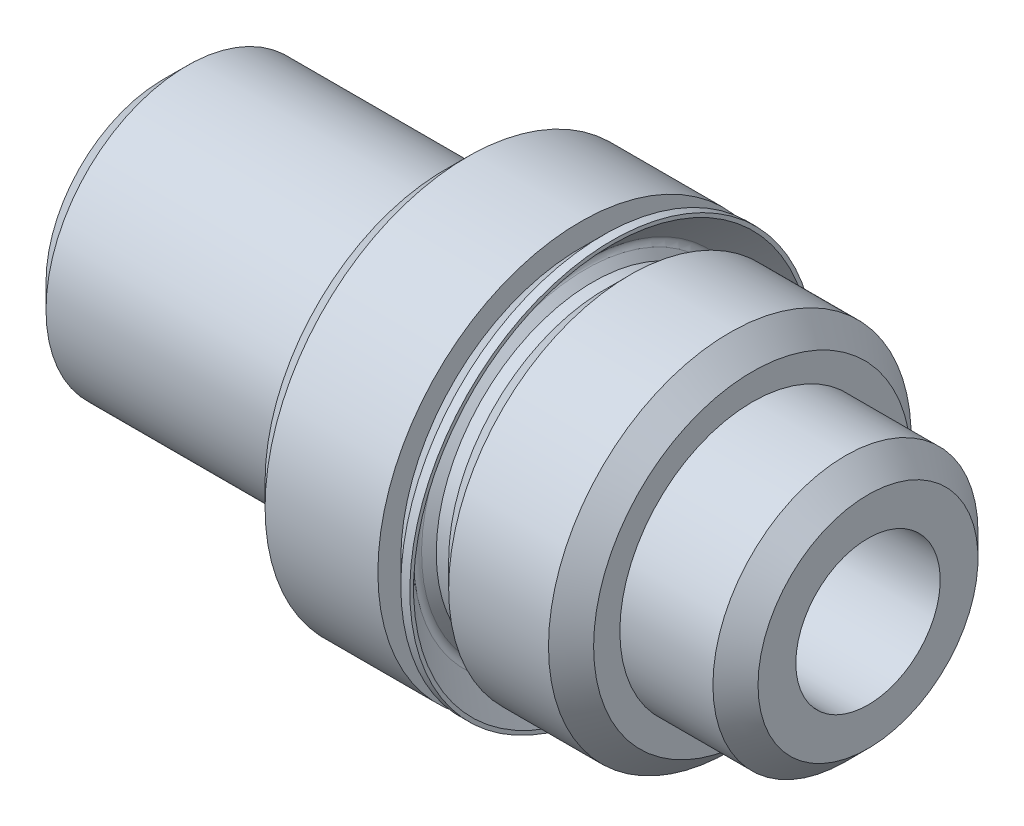
ISO-10303-21;
HEADER;
FILE_DESCRIPTION(('STEP AP214'),'2;1');
FILE_NAME('part.step','',(''),(''),'','','');
FILE_SCHEMA(('AUTOMOTIVE_DESIGN { 1 0 10303 214 1 1 1 1 }'));
ENDSEC;
DATA;
#1=APPLICATION_CONTEXT('core data for automotive mechanical design processes');
#2=APPLICATION_PROTOCOL_DEFINITION('international standard','automotive_design',2000,#1);
#3=PRODUCT_CONTEXT('',#1,'mechanical');
#4=PRODUCT('Part','Part','',(#3));
#5=PRODUCT_RELATED_PRODUCT_CATEGORY('part','',(#4));
#6=PRODUCT_DEFINITION_FORMATION('','',#4);
#7=PRODUCT_DEFINITION_CONTEXT('part definition',#1,'design');
#8=PRODUCT_DEFINITION('design','',#6,#7);
#9=PRODUCT_DEFINITION_SHAPE('','',#8);
#10=(LENGTH_UNIT() NAMED_UNIT(*) SI_UNIT(.MILLI.,.METRE.));
#11=(NAMED_UNIT(*) PLANE_ANGLE_UNIT() SI_UNIT($,.RADIAN.));
#12=(NAMED_UNIT(*) SI_UNIT($,.STERADIAN.) SOLID_ANGLE_UNIT());
#13=UNCERTAINTY_MEASURE_WITH_UNIT(LENGTH_MEASURE(1.E-05),#10,'distance_accuracy_value','');
#14=(GEOMETRIC_REPRESENTATION_CONTEXT(3) GLOBAL_UNCERTAINTY_ASSIGNED_CONTEXT((#13)) GLOBAL_UNIT_ASSIGNED_CONTEXT((#10,
#11,#12)) REPRESENTATION_CONTEXT('',''));
#15=CARTESIAN_POINT('',(0.,0.,0.));
#16=DIRECTION('',(0.,0.,1.));
#17=DIRECTION('',(1.,0.,0.));
#18=AXIS2_PLACEMENT_3D('',#15,#16,#17);
#19=CARTESIAN_POINT('',(9.398,4.5593,0.));
#20=DIRECTION('',(-1.,0.,0.));
#21=DIRECTION('',(0.,0.,1.));
#22=AXIS2_PLACEMENT_3D('',#19,#20,#21);
#23=PLANE('',#22);
#24=CARTESIAN_POINT('',(9.398,0.,0.));
#25=DIRECTION('',(-1.,0.,0.));
#26=DIRECTION('',(0.,0.,1.));
#27=AXIS2_PLACEMENT_3D('',#24,#25,#26);
#28=CIRCLE('',#27,4.5593);
#29=CARTESIAN_POINT('',(9.398,0.,4.5593));
#30=VERTEX_POINT('',#29);
#31=EDGE_CURVE('E67',#30,#30,#28,.T.);
#32=ORIENTED_EDGE('',*,*,#31,.F.);
#33=EDGE_LOOP('',(#32));
#34=FACE_BOUND('',#33,.T.);
#35=CARTESIAN_POINT('',(9.398,0.,0.));
#36=DIRECTION('',(-1.,0.,0.));
#37=DIRECTION('',(0.,0.,1.));
#38=AXIS2_PLACEMENT_3D('',#35,#36,#37);
#39=CIRCLE('',#38,4.04308073452823);
#40=CARTESIAN_POINT('',(9.398,0.,4.04308073452825));
#41=VERTEX_POINT('',#40);
#42=EDGE_CURVE('E10',#41,#41,#39,.F.);
#43=ORIENTED_EDGE('',*,*,#42,.F.);
#44=EDGE_LOOP('',(#43));
#45=FACE_BOUND('',#44,.T.);
#46=ADVANCED_FACE('F35',(#34,#45),#23,.F.);
#47=CARTESIAN_POINT('',(13.2715,0.,0.));
#48=DIRECTION('',(-1.,0.,0.));
#49=DIRECTION('',(0.,0.,1.));
#50=AXIS2_PLACEMENT_3D('',#47,#48,#49);
#51=CYLINDRICAL_SURFACE('',#50,3.52425);
#52=CARTESIAN_POINT('',(9.9568,0.,0.));
#53=DIRECTION('',(-1.,0.,0.));
#54=DIRECTION('',(0.,0.,1.));
#55=AXIS2_PLACEMENT_3D('',#52,#53,#54);
#56=CIRCLE('',#55,3.52425);
#57=CARTESIAN_POINT('',(9.9568,0.,3.52425));
#58=VERTEX_POINT('',#57);
#59=EDGE_CURVE('E70',#58,#58,#56,.T.);
#60=ORIENTED_EDGE('',*,*,#59,.T.);
#61=EDGE_LOOP('',(#60));
#62=FACE_BOUND('',#61,.T.);
#63=CARTESIAN_POINT('',(9.67739999999997,0.,0.));
#64=DIRECTION('',(-1.,0.,0.));
#65=DIRECTION('',(0.,-1.,0.));
#66=AXIS2_PLACEMENT_3D('',#63,#64,#65);
#67=CIRCLE('',#66,3.52425);
#68=CARTESIAN_POINT('',(9.67739999999999,-3.52424999999995,0.));
#69=VERTEX_POINT('',#68);
#70=EDGE_CURVE('E42',#69,#69,#67,.T.);
#71=ORIENTED_EDGE('',*,*,#70,.F.);
#72=EDGE_LOOP('',(#71));
#73=FACE_BOUND('',#72,.T.);
#74=ADVANCED_FACE('F125',(#62,#73),#51,.T.);
#75=CARTESIAN_POINT('',(13.2715,3.57505,0.));
#76=DIRECTION('',(-1.,0.,0.));
#77=DIRECTION('',(0.,0.,1.));
#78=AXIS2_PLACEMENT_3D('',#75,#76,#77);
#79=PLANE('',#78);
#80=CARTESIAN_POINT('',(13.2715,0.,0.));
#81=DIRECTION('',(-1.,0.,0.));
#82=DIRECTION('',(0.,0.,1.));
#83=AXIS2_PLACEMENT_3D('',#80,#81,#82);
#84=CIRCLE('',#83,3.57505);
#85=CARTESIAN_POINT('',(13.2715,0.,3.57505));
#86=VERTEX_POINT('',#85);
#87=EDGE_CURVE('E79',#86,#86,#84,.T.);
#88=ORIENTED_EDGE('',*,*,#87,.F.);
#89=EDGE_LOOP('',(#88));
#90=FACE_BOUND('',#89,.T.);
#91=CARTESIAN_POINT('',(13.2715,0.,0.));
#92=DIRECTION('',(-1.,0.,0.));
#93=DIRECTION('',(0.,0.,1.));
#94=AXIS2_PLACEMENT_3D('',#91,#92,#93);
#95=CIRCLE('',#94,2.9845);
#96=CARTESIAN_POINT('',(13.2715,0.,2.9845));
#97=VERTEX_POINT('',#96);
#98=EDGE_CURVE('E46',#97,#97,#95,.F.);
#99=ORIENTED_EDGE('',*,*,#98,.F.);
#100=EDGE_LOOP('',(#99));
#101=FACE_BOUND('',#100,.T.);
#102=ADVANCED_FACE('F131',(#90,#101),#79,.F.);
#103=CARTESIAN_POINT('',(0.,0.,0.));
#104=DIRECTION('',(1.,0.,0.));
#105=DIRECTION('',(0.,0.,-1.));
#106=AXIS2_PLACEMENT_3D('',#103,#104,#105);
#107=PLANE('',#106);
#108=CARTESIAN_POINT('',(0.,0.,0.));
#109=DIRECTION('',(-1.,0.,0.));
#110=DIRECTION('',(0.,0.,1.));
#111=AXIS2_PLACEMENT_3D('',#108,#109,#110);
#112=CIRCLE('',#111,2.0066);
#113=CARTESIAN_POINT('',(0.,0.,2.0066));
#114=VERTEX_POINT('',#113);
#115=EDGE_CURVE('E94',#114,#114,#112,.T.);
#116=ORIENTED_EDGE('',*,*,#115,.F.);
#117=EDGE_LOOP('',(#116));
#118=FACE_BOUND('',#117,.T.);
#119=CARTESIAN_POINT('',(0.,0.,0.));
#120=DIRECTION('',(-1.,0.,0.));
#121=DIRECTION('',(0.,0.,1.));
#122=AXIS2_PLACEMENT_3D('',#119,#120,#121);
#123=CIRCLE('',#122,2.63398);
#124=CARTESIAN_POINT('',(0.,0.,2.63398));
#125=VERTEX_POINT('',#124);
#126=EDGE_CURVE('E50',#125,#125,#123,.T.);
#127=ORIENTED_EDGE('',*,*,#126,.T.);
#128=EDGE_LOOP('',(#127));
#129=FACE_BOUND('',#128,.T.);
#130=ADVANCED_FACE('F37',(#118,#129),#107,.F.);
#131=CARTESIAN_POINT('',(0.54102,0.,0.));
#132=DIRECTION('',(1.,0.,0.));
#133=DIRECTION('',(0.,0.,-1.));
#134=AXIS2_PLACEMENT_3D('',#131,#132,#133);
#135=CONICAL_SURFACE('',#134,3.175,0.785398163397448);
#136=ORIENTED_EDGE('',*,*,#126,.F.);
#137=EDGE_LOOP('',(#136));
#138=FACE_BOUND('',#137,.T.);
#139=CARTESIAN_POINT('',(0.54102,0.,0.));
#140=DIRECTION('',(-1.,0.,0.));
#141=DIRECTION('',(0.,0.,1.));
#142=AXIS2_PLACEMENT_3D('',#139,#140,#141);
#143=CIRCLE('',#142,3.175);
#144=CARTESIAN_POINT('',(0.54102,0.,3.175));
#145=VERTEX_POINT('',#144);
#146=EDGE_CURVE('E55',#145,#145,#143,.T.);
#147=ORIENTED_EDGE('',*,*,#146,.T.);
#148=EDGE_LOOP('',(#147));
#149=FACE_BOUND('',#148,.T.);
#150=ADVANCED_FACE('F153',(#138,#149),#135,.T.);
#151=CARTESIAN_POINT('',(6.35,0.,0.));
#152=DIRECTION('',(-1.,0.,0.));
#153=DIRECTION('',(0.,0.,1.));
#154=AXIS2_PLACEMENT_3D('',#151,#152,#153);
#155=CYLINDRICAL_SURFACE('',#154,3.175);
#156=ORIENTED_EDGE('',*,*,#146,.F.);
#157=EDGE_LOOP('',(#156));
#158=FACE_BOUND('',#157,.T.);
#159=CARTESIAN_POINT('',(6.35,0.,0.));
#160=DIRECTION('',(1.,0.,0.));
#161=DIRECTION('',(0.,0.,-1.));
#162=AXIS2_PLACEMENT_3D('',#159,#160,#161);
#163=CIRCLE('',#162,3.175);
#164=CARTESIAN_POINT('',(6.35,0.,-3.175));
#165=VERTEX_POINT('',#164);
#166=EDGE_CURVE('E58',#165,#165,#163,.T.);
#167=ORIENTED_EDGE('',*,*,#166,.F.);
#168=EDGE_LOOP('',(#167));
#169=FACE_BOUND('',#168,.T.);
#170=ADVANCED_FACE('F150',(#158,#169),#155,.T.);
#171=CARTESIAN_POINT('',(6.35,0.,0.));
#172=DIRECTION('',(1.,0.,0.));
#173=DIRECTION('',(0.,0.,-1.));
#174=AXIS2_PLACEMENT_3D('',#171,#172,#173);
#175=PLANE('',#174);
#176=CARTESIAN_POINT('',(6.35,0.,0.));
#177=DIRECTION('',(-1.,0.,0.));
#178=DIRECTION('',(0.,0.,1.));
#179=AXIS2_PLACEMENT_3D('',#176,#177,#178);
#180=CIRCLE('',#179,4.0513);
#181=CARTESIAN_POINT('',(6.35,0.,4.0513));
#182=VERTEX_POINT('',#181);
#183=EDGE_CURVE('E61',#182,#182,#180,.T.);
#184=ORIENTED_EDGE('',*,*,#183,.T.);
#185=EDGE_LOOP('',(#184));
#186=FACE_BOUND('',#185,.T.);
#187=ORIENTED_EDGE('',*,*,#166,.T.);
#188=EDGE_LOOP('',(#187));
#189=FACE_BOUND('',#188,.T.);
#190=ADVANCED_FACE('F146',(#186,#189),#175,.F.);
#191=CARTESIAN_POINT('',(6.858,0.,0.));
#192=DIRECTION('',(1.,0.,0.));
#193=DIRECTION('',(0.,0.,-1.));
#194=AXIS2_PLACEMENT_3D('',#191,#192,#193);
#195=CONICAL_SURFACE('',#194,4.5593,0.785398163397448);
#196=ORIENTED_EDGE('',*,*,#183,.F.);
#197=EDGE_LOOP('',(#196));
#198=FACE_BOUND('',#197,.T.);
#199=CARTESIAN_POINT('',(6.858,0.,0.));
#200=DIRECTION('',(-1.,0.,0.));
#201=DIRECTION('',(0.,0.,1.));
#202=AXIS2_PLACEMENT_3D('',#199,#200,#201);
#203=CIRCLE('',#202,4.5593);
#204=CARTESIAN_POINT('',(6.858,0.,4.5593));
#205=VERTEX_POINT('',#204);
#206=EDGE_CURVE('E64',#205,#205,#203,.T.);
#207=ORIENTED_EDGE('',*,*,#206,.T.);
#208=EDGE_LOOP('',(#207));
#209=FACE_BOUND('',#208,.T.);
#210=ADVANCED_FACE('F142',(#198,#209),#195,.T.);
#211=CARTESIAN_POINT('',(13.2715,0.,0.));
#212=DIRECTION('',(-1.,0.,0.));
#213=DIRECTION('',(0.,0.,1.));
#214=AXIS2_PLACEMENT_3D('',#211,#212,#213);
#215=CYLINDRICAL_SURFACE('',#214,4.5593);
#216=ORIENTED_EDGE('',*,*,#206,.F.);
#217=EDGE_LOOP('',(#216));
#218=FACE_BOUND('',#217,.T.);
#219=ORIENTED_EDGE('',*,*,#31,.T.);
#220=EDGE_LOOP('',(#219));
#221=FACE_BOUND('',#220,.T.);
#222=ADVANCED_FACE('F138',(#218,#221),#215,.T.);
#223=CARTESIAN_POINT('',(10.5156,0.,0.));
#224=DIRECTION('',(1.,0.,0.));
#225=DIRECTION('',(0.,0.,-1.));
#226=AXIS2_PLACEMENT_3D('',#223,#224,#225);
#227=CONICAL_SURFACE('',#226,4.08305,0.785398163397449);
#228=ORIENTED_EDGE('',*,*,#59,.F.);
#229=EDGE_LOOP('',(#228));
#230=FACE_BOUND('',#229,.T.);
#231=CARTESIAN_POINT('',(10.5156,0.,0.));
#232=DIRECTION('',(-1.,0.,0.));
#233=DIRECTION('',(0.,0.,1.));
#234=AXIS2_PLACEMENT_3D('',#231,#232,#233);
#235=CIRCLE('',#234,4.08305);
#236=CARTESIAN_POINT('',(10.5156,0.,4.08305));
#237=VERTEX_POINT('',#236);
#238=EDGE_CURVE('E73',#237,#237,#235,.T.);
#239=ORIENTED_EDGE('',*,*,#238,.T.);
#240=EDGE_LOOP('',(#239));
#241=FACE_BOUND('',#240,.T.);
#242=ADVANCED_FACE('F141',(#230,#241),#227,.T.);
#243=CARTESIAN_POINT('',(13.2715,0.,0.));
#244=DIRECTION('',(-1.,0.,0.));
#245=DIRECTION('',(0.,0.,1.));
#246=AXIS2_PLACEMENT_3D('',#243,#244,#245);
#247=CYLINDRICAL_SURFACE('',#246,4.08305);
#248=ORIENTED_EDGE('',*,*,#238,.F.);
#249=EDGE_LOOP('',(#248));
#250=FACE_BOUND('',#249,.T.);
#251=CARTESIAN_POINT('',(12.7635,0.,0.));
#252=DIRECTION('',(-1.,0.,0.));
#253=DIRECTION('',(0.,0.,1.));
#254=AXIS2_PLACEMENT_3D('',#251,#252,#253);
#255=CIRCLE('',#254,4.08305);
#256=CARTESIAN_POINT('',(12.7635,0.,4.08305));
#257=VERTEX_POINT('',#256);
#258=EDGE_CURVE('E76',#257,#257,#255,.T.);
#259=ORIENTED_EDGE('',*,*,#258,.T.);
#260=EDGE_LOOP('',(#259));
#261=FACE_BOUND('',#260,.T.);
#262=ADVANCED_FACE('F207',(#250,#261),#247,.T.);
#263=CARTESIAN_POINT('',(13.2715,0.,0.));
#264=DIRECTION('',(-1.,0.,0.));
#265=DIRECTION('',(0.,0.,1.));
#266=AXIS2_PLACEMENT_3D('',#263,#264,#265);
#267=CONICAL_SURFACE('',#266,3.57505,0.785398163397449);
#268=ORIENTED_EDGE('',*,*,#258,.F.);
#269=EDGE_LOOP('',(#268));
#270=FACE_BOUND('',#269,.T.);
#271=ORIENTED_EDGE('',*,*,#87,.T.);
#272=EDGE_LOOP('',(#271));
#273=FACE_BOUND('',#272,.T.);
#274=ADVANCED_FACE('F202',(#270,#273),#267,.T.);
#275=CARTESIAN_POINT('',(15.875,0.,0.));
#276=DIRECTION('',(-1.,0.,0.));
#277=DIRECTION('',(0.,0.,1.));
#278=AXIS2_PLACEMENT_3D('',#275,#276,#277);
#279=CYLINDRICAL_SURFACE('',#278,2.9845);
#280=ORIENTED_EDGE('',*,*,#98,.T.);
#281=EDGE_LOOP('',(#280));
#282=FACE_BOUND('',#281,.T.);
#283=CARTESIAN_POINT('',(15.367,0.,0.));
#284=DIRECTION('',(-1.,0.,0.));
#285=DIRECTION('',(0.,0.,1.));
#286=AXIS2_PLACEMENT_3D('',#283,#284,#285);
#287=CIRCLE('',#286,2.9845);
#288=CARTESIAN_POINT('',(15.367,0.,2.9845));
#289=VERTEX_POINT('',#288);
#290=EDGE_CURVE('E82',#289,#289,#287,.T.);
#291=ORIENTED_EDGE('',*,*,#290,.T.);
#292=EDGE_LOOP('',(#291));
#293=FACE_BOUND('',#292,.T.);
#294=ADVANCED_FACE('F199',(#282,#293),#279,.T.);
#295=CARTESIAN_POINT('',(15.875,0.,0.));
#296=DIRECTION('',(-1.,0.,0.));
#297=DIRECTION('',(0.,0.,1.));
#298=AXIS2_PLACEMENT_3D('',#295,#296,#297);
#299=CONICAL_SURFACE('',#298,2.4765,0.785398163397448);
#300=ORIENTED_EDGE('',*,*,#290,.F.);
#301=EDGE_LOOP('',(#300));
#302=FACE_BOUND('',#301,.T.);
#303=CARTESIAN_POINT('',(15.875,0.,0.));
#304=DIRECTION('',(-1.,0.,0.));
#305=DIRECTION('',(0.,0.,1.));
#306=AXIS2_PLACEMENT_3D('',#303,#304,#305);
#307=CIRCLE('',#306,2.4765);
#308=CARTESIAN_POINT('',(15.875,0.,2.4765));
#309=VERTEX_POINT('',#308);
#310=EDGE_CURVE('E85',#309,#309,#307,.T.);
#311=ORIENTED_EDGE('',*,*,#310,.T.);
#312=EDGE_LOOP('',(#311));
#313=FACE_BOUND('',#312,.T.);
#314=ADVANCED_FACE('F195',(#302,#313),#299,.T.);
#315=CARTESIAN_POINT('',(15.875,2.4765,0.));
#316=DIRECTION('',(-1.,0.,0.));
#317=DIRECTION('',(0.,0.,1.));
#318=AXIS2_PLACEMENT_3D('',#315,#316,#317);
#319=PLANE('',#318);
#320=CARTESIAN_POINT('',(15.875,0.,0.));
#321=DIRECTION('',(-1.,0.,0.));
#322=DIRECTION('',(0.,0.,1.));
#323=AXIS2_PLACEMENT_3D('',#320,#321,#322);
#324=CIRCLE('',#323,1.6256);
#325=CARTESIAN_POINT('',(15.875,0.,1.6256));
#326=VERTEX_POINT('',#325);
#327=EDGE_CURVE('E88',#326,#326,#324,.T.);
#328=ORIENTED_EDGE('',*,*,#327,.T.);
#329=EDGE_LOOP('',(#328));
#330=FACE_BOUND('',#329,.T.);
#331=ORIENTED_EDGE('',*,*,#310,.F.);
#332=EDGE_LOOP('',(#331));
#333=FACE_BOUND('',#332,.T.);
#334=ADVANCED_FACE('F187',(#330,#333),#319,.F.);
#335=CARTESIAN_POINT('',(0.,0.,0.));
#336=DIRECTION('',(-1.,0.,0.));
#337=DIRECTION('',(0.,0.,1.));
#338=AXIS2_PLACEMENT_3D('',#335,#336,#337);
#339=CYLINDRICAL_SURFACE('',#338,1.6256);
#340=ORIENTED_EDGE('',*,*,#327,.F.);
#341=EDGE_LOOP('',(#340));
#342=FACE_BOUND('',#341,.T.);
#343=CARTESIAN_POINT('',(0.380999999999992,0.,0.));
#344=DIRECTION('',(-1.,0.,0.));
#345=DIRECTION('',(0.,0.,1.));
#346=AXIS2_PLACEMENT_3D('',#343,#344,#345);
#347=CIRCLE('',#346,1.6256);
#348=CARTESIAN_POINT('',(0.380999999999992,0.,1.6256));
#349=VERTEX_POINT('',#348);
#350=EDGE_CURVE('E91',#349,#349,#347,.T.);
#351=ORIENTED_EDGE('',*,*,#350,.T.);
#352=EDGE_LOOP('',(#351));
#353=FACE_BOUND('',#352,.T.);
#354=ADVANCED_FACE('F178',(#342,#353),#339,.F.);
#355=CARTESIAN_POINT('',(0.,0.,0.));
#356=DIRECTION('',(-1.,0.,0.));
#357=DIRECTION('',(0.,0.,1.));
#358=AXIS2_PLACEMENT_3D('',#355,#356,#357);
#359=CONICAL_SURFACE('',#358,2.0066,0.785398163397454);
#360=ORIENTED_EDGE('',*,*,#350,.F.);
#361=EDGE_LOOP('',(#360));
#362=FACE_BOUND('',#361,.T.);
#363=ORIENTED_EDGE('',*,*,#115,.T.);
#364=EDGE_LOOP('',(#363));
#365=FACE_BOUND('',#364,.T.);
#366=ADVANCED_FACE('F175',(#362,#365),#359,.F.);
#367=CARTESIAN_POINT('',(9.91421926547172,0.,0.));
#368=DIRECTION('',(1.,0.,0.));
#369=DIRECTION('',(0.,1.,0.));
#370=AXIS2_PLACEMENT_3D('',#367,#368,#369);
#371=CONICAL_SURFACE('',#370,4.55929999999995,0.785398163397444);
#372=ORIENTED_EDGE('',*,*,#42,.T.);
#373=EDGE_LOOP('',(#372));
#374=FACE_BOUND('',#373,.T.);
#375=CARTESIAN_POINT('',(9.91421926547172,0.,0.));
#376=DIRECTION('',(-1.,0.,0.));
#377=DIRECTION('',(0.,-1.,0.));
#378=AXIS2_PLACEMENT_3D('',#375,#376,#377);
#379=CIRCLE('',#378,4.55929999999995);
#380=CARTESIAN_POINT('',(9.91421926547175,-4.5592999999999,0.));
#381=VERTEX_POINT('',#380);
#382=EDGE_CURVE('E97',#381,#381,#379,.T.);
#383=ORIENTED_EDGE('',*,*,#382,.T.);
#384=EDGE_LOOP('',(#383));
#385=FACE_BOUND('',#384,.T.);
#386=ADVANCED_FACE('F177',(#374,#385),#371,.T.);
#387=CARTESIAN_POINT('',(9.9568,0.,0.));
#388=DIRECTION('',(-1.,0.,0.));
#389=DIRECTION('',(0.,-1.,0.));
#390=AXIS2_PLACEMENT_3D('',#387,#388,#389);
#391=CYLINDRICAL_SURFACE('',#390,4.55929999999995);
#392=ORIENTED_EDGE('',*,*,#382,.F.);
#393=EDGE_LOOP('',(#392));
#394=FACE_BOUND('',#393,.T.);
#395=CARTESIAN_POINT('',(10.1174192654719,0.,0.));
#396=DIRECTION('',(-1.,0.,0.));
#397=DIRECTION('',(0.,-1.,0.));
#398=AXIS2_PLACEMENT_3D('',#395,#396,#397);
#399=CIRCLE('',#398,4.55929999999995);
#400=CARTESIAN_POINT('',(10.1174192654719,-4.5592999999999,0.));
#401=VERTEX_POINT('',#400);
#402=EDGE_CURVE('E100',#401,#401,#399,.T.);
#403=ORIENTED_EDGE('',*,*,#402,.T.);
#404=EDGE_LOOP('',(#403));
#405=FACE_BOUND('',#404,.T.);
#406=ADVANCED_FACE('F185',(#394,#405),#391,.T.);
#407=CARTESIAN_POINT('',(10.1174192654718,4.47513180412595,0.));
#408=DIRECTION('',(-1.,0.,0.));
#409=DIRECTION('',(0.,-1.,0.));
#410=AXIS2_PLACEMENT_3D('',#407,#408,#409);
#411=PLANE('',#410);
#412=ORIENTED_EDGE('',*,*,#402,.F.);
#413=EDGE_LOOP('',(#412));
#414=FACE_BOUND('',#413,.T.);
#415=CARTESIAN_POINT('',(10.1174192654719,0.,0.));
#416=DIRECTION('',(-1.,0.,0.));
#417=DIRECTION('',(0.,-1.,0.));
#418=AXIS2_PLACEMENT_3D('',#415,#416,#417);
#419=CIRCLE('',#418,4.4751318041259);
#420=CARTESIAN_POINT('',(10.1174192654719,-4.47513180412585,0.));
#421=VERTEX_POINT('',#420);
#422=EDGE_CURVE('E103',#421,#421,#419,.T.);
#423=ORIENTED_EDGE('',*,*,#422,.T.);
#424=EDGE_LOOP('',(#423));
#425=FACE_BOUND('',#424,.T.);
#426=ADVANCED_FACE('F275',(#414,#425),#411,.F.);
#427=CARTESIAN_POINT('',(9.51177129188362,0.,0.));
#428=DIRECTION('',(1.,0.,0.));
#429=DIRECTION('',(0.,1.,0.));
#430=AXIS2_PLACEMENT_3D('',#427,#428,#429);
#431=CONICAL_SURFACE('',#430,3.86948383053765,0.785398163397443);
#432=ORIENTED_EDGE('',*,*,#422,.F.);
#433=EDGE_LOOP('',(#432));
#434=FACE_BOUND('',#433,.T.);
#435=CARTESIAN_POINT('',(9.51177129188362,0.,0.));
#436=DIRECTION('',(-1.,0.,0.));
#437=DIRECTION('',(0.,-1.,0.));
#438=AXIS2_PLACEMENT_3D('',#435,#436,#437);
#439=CIRCLE('',#438,3.86948383053765);
#440=CARTESIAN_POINT('',(9.51177129188364,-3.8694838305376,0.));
#441=VERTEX_POINT('',#440);
#442=EDGE_CURVE('E106',#441,#441,#439,.T.);
#443=ORIENTED_EDGE('',*,*,#442,.T.);
#444=EDGE_LOOP('',(#443));
#445=FACE_BOUND('',#444,.T.);
#446=ADVANCED_FACE('F121',(#434,#445),#431,.F.);
#447=CARTESIAN_POINT('',(9.60157385309424,0.,0.));
#448=DIRECTION('',(-1.,0.,0.));
#449=DIRECTION('',(0.,-1.,0.));
#450=AXIS2_PLACEMENT_3D('',#447,#448,#449);
#451=TOROIDAL_SURFACE('',#450,3.779681269327,0.126999999999922);
#452=ORIENTED_EDGE('',*,*,#442,.F.);
#453=EDGE_LOOP('',(#452));
#454=FACE_BOUND('',#453,.T.);
#455=CARTESIAN_POINT('',(9.51177129188362,0.,0.));
#456=DIRECTION('',(-1.,0.,0.));
#457=DIRECTION('',(0.,-1.,0.));
#458=AXIS2_PLACEMENT_3D('',#455,#456,#457);
#459=CIRCLE('',#458,3.68987870811635);
#460=CARTESIAN_POINT('',(9.51177129188364,-3.6898787081163,0.));
#461=VERTEX_POINT('',#460);
#462=EDGE_CURVE('E109',#461,#461,#459,.T.);
#463=ORIENTED_EDGE('',*,*,#462,.T.);
#464=EDGE_LOOP('',(#463));
#465=FACE_BOUND('',#464,.T.);
#466=ADVANCED_FACE('F113',(#454,#465),#451,.F.);
#467=CARTESIAN_POINT('',(9.67740000000002,0.,0.));
#468=DIRECTION('',(-1.,0.,0.));
#469=DIRECTION('',(0.,-1.,0.));
#470=AXIS2_PLACEMENT_3D('',#467,#468,#469);
#471=CONICAL_SURFACE('',#470,3.52424999999995,0.785398163397451);
#472=ORIENTED_EDGE('',*,*,#462,.F.);
#473=EDGE_LOOP('',(#472));
#474=FACE_BOUND('',#473,.T.);
#475=ORIENTED_EDGE('',*,*,#70,.T.);
#476=EDGE_LOOP('',(#475));
#477=FACE_BOUND('',#476,.T.);
#478=ADVANCED_FACE('F115',(#474,#477),#471,.T.);
#479=CLOSED_SHELL('',(#46,#74,#102,#130,#150,#170,#190,#210,#222,#242,#262,#274,#294,#314,#334,
#354,#366,#386,#406,#426,#446,#466,#478));
#480=MANIFOLD_SOLID_BREP('B2',#479);
#481=ADVANCED_BREP_SHAPE_REPRESENTATION('',(#18,#480),#14);
#482=SHAPE_DEFINITION_REPRESENTATION(#9,#481);
ENDSEC;
END-ISO-10303-21;
